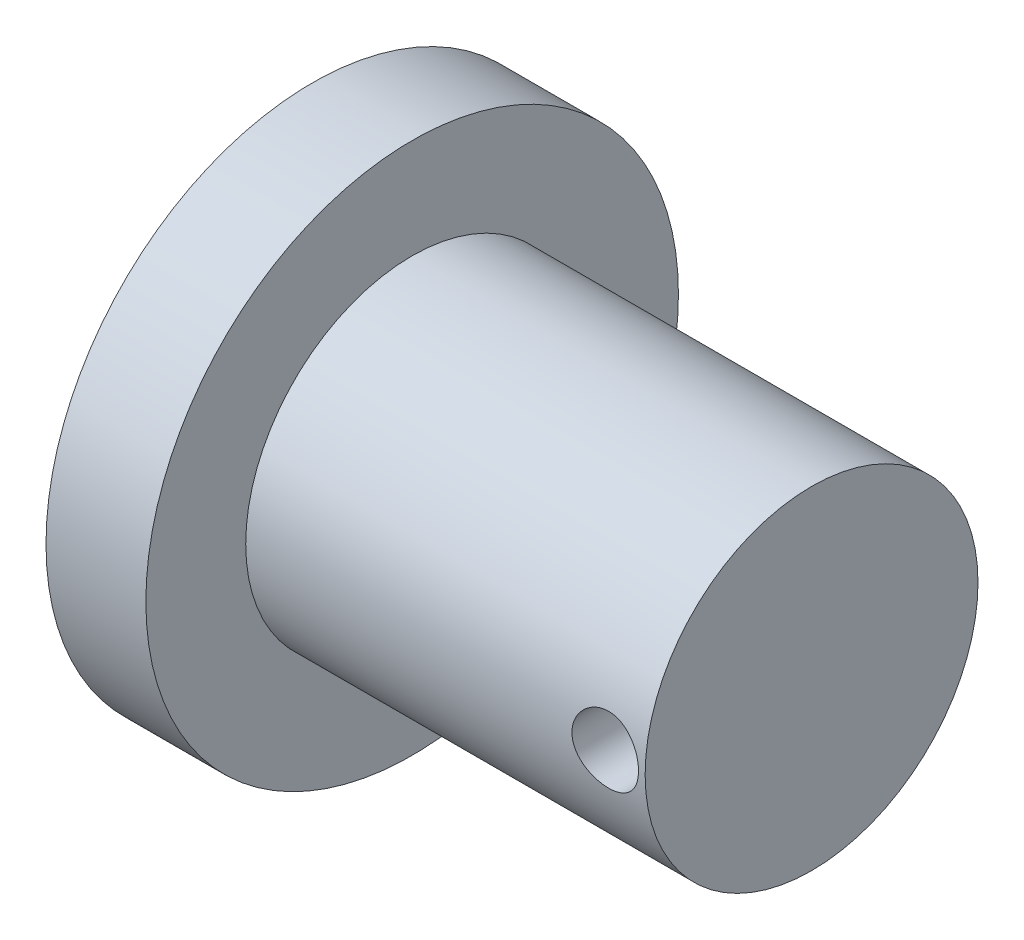
ISO-10303-21;
HEADER;
FILE_DESCRIPTION(('STEP AP214'),'2;1');
FILE_NAME('part.step','',(''),(''),'','','');
FILE_SCHEMA(('AUTOMOTIVE_DESIGN { 1 0 10303 214 1 1 1 1 }'));
ENDSEC;
DATA;
#1=APPLICATION_CONTEXT('core data for automotive mechanical design processes');
#2=APPLICATION_PROTOCOL_DEFINITION('international standard','automotive_design',2000,#1);
#3=PRODUCT_CONTEXT('',#1,'mechanical');
#4=PRODUCT('Part','Part','',(#3));
#5=PRODUCT_RELATED_PRODUCT_CATEGORY('part','',(#4));
#6=PRODUCT_DEFINITION_FORMATION('','',#4);
#7=PRODUCT_DEFINITION_CONTEXT('part definition',#1,'design');
#8=PRODUCT_DEFINITION('design','',#6,#7);
#9=PRODUCT_DEFINITION_SHAPE('','',#8);
#10=(LENGTH_UNIT() NAMED_UNIT(*) SI_UNIT(.MILLI.,.METRE.));
#11=(NAMED_UNIT(*) PLANE_ANGLE_UNIT() SI_UNIT($,.RADIAN.));
#12=(NAMED_UNIT(*) SI_UNIT($,.STERADIAN.) SOLID_ANGLE_UNIT());
#13=UNCERTAINTY_MEASURE_WITH_UNIT(LENGTH_MEASURE(1.E-05),#10,'distance_accuracy_value','');
#14=(GEOMETRIC_REPRESENTATION_CONTEXT(3) GLOBAL_UNCERTAINTY_ASSIGNED_CONTEXT((#13)) GLOBAL_UNIT_ASSIGNED_CONTEXT((#10,
#11,#12)) REPRESENTATION_CONTEXT('',''));
#15=CARTESIAN_POINT('',(0.,0.,0.));
#16=DIRECTION('',(0.,0.,1.));
#17=DIRECTION('',(1.,0.,0.));
#18=AXIS2_PLACEMENT_3D('',#15,#16,#17);
#19=CARTESIAN_POINT('',(-25.0884955752212,8.,0.));
#20=DIRECTION('',(1.,0.,0.));
#21=DIRECTION('',(0.,0.,-1.));
#22=AXIS2_PLACEMENT_3D('',#19,#20,#21);
#23=PLANE('',#22);
#24=CARTESIAN_POINT('',(-25.0884955752212,0.,0.));
#25=DIRECTION('',(-1.,0.,0.));
#26=DIRECTION('',(0.,0.,1.));
#27=AXIS2_PLACEMENT_3D('',#24,#25,#26);
#28=CIRCLE('',#27,8.);
#29=CARTESIAN_POINT('',(-25.0884955752212,0.,8.));
#30=VERTEX_POINT('',#29);
#31=EDGE_CURVE('E95',#30,#30,#28,.T.);
#32=ORIENTED_EDGE('',*,*,#31,.T.);
#33=EDGE_LOOP('',(#32));
#34=FACE_BOUND('',#33,.T.);
#35=ADVANCED_FACE('F37',(#34),#23,.F.);
#36=CARTESIAN_POINT('',(-10.0884955752212,0.,0.));
#37=DIRECTION('',(-1.,0.,0.));
#38=DIRECTION('',(0.,0.,1.));
#39=AXIS2_PLACEMENT_3D('',#36,#37,#38);
#40=PLANE('',#39);
#41=CARTESIAN_POINT('',(-10.0884955752212,0.,0.));
#42=DIRECTION('',(-1.,0.,0.));
#43=DIRECTION('',(0.,0.,1.));
#44=AXIS2_PLACEMENT_3D('',#41,#42,#43);
#45=CIRCLE('',#44,5.);
#46=CARTESIAN_POINT('',(-10.0884955752212,0.,5.));
#47=VERTEX_POINT('',#46);
#48=EDGE_CURVE('E10',#47,#47,#45,.T.);
#49=ORIENTED_EDGE('',*,*,#48,.F.);
#50=EDGE_LOOP('',(#49));
#51=FACE_BOUND('',#50,.T.);
#52=ADVANCED_FACE('F83',(#51),#40,.F.);
#53=CARTESIAN_POINT('',(-25.0884955752212,0.,0.));
#54=DIRECTION('',(-1.,0.,0.));
#55=DIRECTION('',(0.,0.,1.));
#56=AXIS2_PLACEMENT_3D('',#53,#54,#55);
#57=CYLINDRICAL_SURFACE('',#56,5.);
#58=CARTESIAN_POINT('',(-10.2884955752212,0.,5.));
#59=CARTESIAN_POINT('',(-10.2884976197196,-0.0555769067926333,4.99999897580871));
#60=CARTESIAN_POINT('',(-10.2931444181889,-0.111179660201523,4.99906385178231));
#61=CARTESIAN_POINT('',(-10.3115940753365,-0.22081350768902,4.99542365623231));
#62=CARTESIAN_POINT('',(-10.3254042080227,-0.274843317541356,4.99271717860186));
#63=CARTESIAN_POINT('',(-10.361736848842,-0.379730305263313,4.98583649278287));
#64=CARTESIAN_POINT('',(-10.3842510120659,-0.430590467933134,4.98166369076718));
#65=CARTESIAN_POINT('',(-10.4373278227325,-0.527807988864225,4.97230398035314));
#66=CARTESIAN_POINT('',(-10.4678899908284,-0.574165615075812,4.96711713235707));
#67=CARTESIAN_POINT('',(-10.5366340695127,-0.661693477314866,4.9562216532997));
#68=CARTESIAN_POINT('',(-10.5749039306124,-0.702793951158525,4.95050745504347));
#69=CARTESIAN_POINT('',(-10.6577879916129,-0.778036756608029,4.93924180452588));
#70=CARTESIAN_POINT('',(-10.7024026865563,-0.812178544770425,4.93369036500424));
#71=CARTESIAN_POINT('',(-10.7972117682331,-0.872831753347621,4.92332441812615));
#72=CARTESIAN_POINT('',(-10.8474532190176,-0.899270938865868,4.91851707364946));
#73=CARTESIAN_POINT('',(-10.9517773942253,-0.943305666580309,4.91026268058418));
#74=CARTESIAN_POINT('',(-11.0058597385676,-0.960902082437239,4.90681549761962));
#75=CARTESIAN_POINT('',(-11.1155799391291,-0.986525299884828,4.90172805252204));
#76=CARTESIAN_POINT('',(-11.1711881193634,-0.994674497958778,4.90006470107188));
#77=CARTESIAN_POINT('',(-11.2830053965856,-1.00155212772612,4.89866375060627));
#78=CARTESIAN_POINT('',(-11.3392144315414,-1.0002815227135,4.89892595467841));
#79=CARTESIAN_POINT('',(-11.4497423632422,-0.98845457310182,4.90132551148184));
#80=CARTESIAN_POINT('',(-11.5040769808485,-0.978038540243907,4.90343452858763));
#81=CARTESIAN_POINT('',(-11.6102116518842,-0.948437884623052,4.90924546160001));
#82=CARTESIAN_POINT('',(-11.6620115841402,-0.929252843100683,4.91294745357779));
#83=CARTESIAN_POINT('',(-11.7620108369248,-0.882524783674721,4.92155618500408));
#84=CARTESIAN_POINT('',(-11.8101834547904,-0.854926151232116,4.92647089813704));
#85=CARTESIAN_POINT('',(-11.901266425194,-0.79219357457268,4.93694618773062));
#86=CARTESIAN_POINT('',(-11.9441761720724,-0.75705876435683,4.94250683838366));
#87=CARTESIAN_POINT('',(-12.0243249776782,-0.679499934560585,4.95377021241462));
#88=CARTESIAN_POINT('',(-12.0614481430804,-0.636956161212446,4.95947369210905));
#89=CARTESIAN_POINT('',(-12.1280494215224,-0.54618502406201,4.97028848714408));
#90=CARTESIAN_POINT('',(-12.1575274365148,-0.49795758737939,4.97539979488974));
#91=CARTESIAN_POINT('',(-12.2080230844472,-0.397059386878922,4.98446690160887));
#92=CARTESIAN_POINT('',(-12.2290274688658,-0.344381819585301,4.98842088848272));
#93=CARTESIAN_POINT('',(-12.2618560492598,-0.236148976448666,4.99471408987858));
#94=CARTESIAN_POINT('',(-12.2736813572948,-0.180594050072451,4.99705350000531));
#95=CARTESIAN_POINT('',(-12.2876520290155,-0.0691794056271513,4.99982671866868));
#96=CARTESIAN_POINT('',(-12.2899559947615,-0.0133403283255771,5.0002917465247));
#97=CARTESIAN_POINT('',(-12.285245716279,0.0979249341927132,4.99935051930103));
#98=CARTESIAN_POINT('',(-12.2782319958686,0.153351142443792,4.99794436941446));
#99=CARTESIAN_POINT('',(-12.2552172016773,0.26170565994654,4.99343832008018));
#100=CARTESIAN_POINT('',(-12.2392975067233,0.314651948339903,4.99035376404206));
#101=CARTESIAN_POINT('',(-12.1990115925654,0.417123627499667,4.98283552061032));
#102=CARTESIAN_POINT('',(-12.1746447405444,0.466648761637539,4.97840173214227));
#103=CARTESIAN_POINT('',(-12.1178130845699,0.561541173686217,4.96859911533294));
#104=CARTESIAN_POINT('',(-12.0852527941823,0.606850126752188,4.96321950437052));
#105=CARTESIAN_POINT('',(-12.0130863840139,0.691418019119207,4.95214734829882));
#106=CARTESIAN_POINT('',(-11.9734795088214,0.730676308930763,4.94645476968388));
#107=CARTESIAN_POINT('',(-11.8876222233301,0.802640590774177,4.93529303556965));
#108=CARTESIAN_POINT('',(-11.8412798309999,0.835237702448656,4.92982860233304));
#109=CARTESIAN_POINT('',(-11.7436842138645,0.892185420051206,4.91984191796194));
#110=CARTESIAN_POINT('',(-11.6924311856477,0.916536355922903,4.91531962913342));
#111=CARTESIAN_POINT('',(-11.5867273290717,0.956151841581961,4.90776740584383));
#112=CARTESIAN_POINT('',(-11.5322947340109,0.971463499791052,4.90472974872186));
#113=CARTESIAN_POINT('',(-11.4215621217303,0.992708651627198,4.90047436792025));
#114=CARTESIAN_POINT('',(-11.3652623490119,0.998643368225114,4.89925640691111));
#115=CARTESIAN_POINT('',(-11.2534867106769,1.00092091086747,4.89879149631379));
#116=CARTESIAN_POINT('',(-11.1980144262942,0.997435788070897,4.89950919189301));
#117=CARTESIAN_POINT('',(-11.0884639253162,0.981352304100062,4.90275573484614));
#118=CARTESIAN_POINT('',(-11.0343856975264,0.9687540161293,4.90528456767169));
#119=CARTESIAN_POINT('',(-10.9292678639807,0.934878568498956,4.91185264219158));
#120=CARTESIAN_POINT('',(-10.8782212147188,0.913622506717347,4.9158882101883));
#121=CARTESIAN_POINT('',(-10.7803918544868,0.863054644601606,4.9250171497417));
#122=CARTESIAN_POINT('',(-10.7336095014961,0.833742168774884,4.93011060998894));
#123=CARTESIAN_POINT('',(-10.6447800030709,0.767305914786415,4.94088960523225));
#124=CARTESIAN_POINT('',(-10.6028268099536,0.730057887235181,4.94658372909699));
#125=CARTESIAN_POINT('',(-10.525709369692,0.649064369013141,4.95786081871955));
#126=CARTESIAN_POINT('',(-10.4905466849039,0.605317387153335,4.96344375863184));
#127=CARTESIAN_POINT('',(-10.4276609312748,0.512017629088247,4.97393832387971));
#128=CARTESIAN_POINT('',(-10.4000195719412,0.462408884429835,4.97884231219246));
#129=CARTESIAN_POINT('',(-10.3535094526246,0.359166360940733,4.98735125085));
#130=CARTESIAN_POINT('',(-10.3346327856887,0.305536260863127,4.99095737138616));
#131=CARTESIAN_POINT('',(-10.3098436271765,0.20982148892378,4.9957637259537));
#132=CARTESIAN_POINT('',(-10.3018523815135,0.168281664013785,4.99734303158452));
#133=CARTESIAN_POINT('',(-10.2911776628629,0.0844995252100672,4.99946154139893));
#134=CARTESIAN_POINT('',(-10.2884940207115,0.0422572337486192,5.00000077873155));
#135=CARTESIAN_POINT('',(-10.2884955752212,0.,5.));
#136=B_SPLINE_CURVE_WITH_KNOTS('',3,(#58,#59,#60,#61,#62,#63,#64,#65,#66,#67,#68,#69,#70,#71,
#72,#73,#74,#75,#76,#77,#78,#79,#80,#81,#82,#83,#84,#85,#86,#87,#88,#89,#90,#91,#92,#93,#94,#95,
#96,#97,#98,#99,#100,#101,#102,#103,#104,#105,#106,#107,#108,#109,#110,#111,#112,#113,#114,#115,
#116,#117,#118,#119,#120,#121,#122,#123,#124,#125,#126,#127,#128,#129,#130,#131,#132,#133,#134,
#135),.UNSPECIFIED.,.T.,.F.,(4,2,2,2,2,2,2,2,2,2,2,2,2,2,2,2,2,2,2,2,2,2,2,2,2,2,2,2,2,2,2,2,2,
2,2,2,2,2,4),(0.,0.166576130661259,0.333284650691323,0.499833735250342,0.666372902230863,
0.834932670112187,1.00350559674737,1.17361195005923,1.34370149365198,1.51156185103588,
1.67940504281225,1.84471727006278,2.0100373925373,2.17647490203593,2.34293154749671,
2.51238252491351,2.68183567539821,2.85155274854024,3.02124925698036,3.18810735676266,
3.35495607657868,3.52030453950724,3.68566539216023,3.85305066033359,4.02045388345931,
4.19040628579226,4.36035188723467,4.52940381032724,4.69843368330415,4.86439722567702,
5.03035943492609,5.19591961253111,5.36149367581867,5.52988076239144,5.69830654532931,
5.86849496675638,6.0385295551752,6.16518775289895,6.29184191370997),.UNSPECIFIED.);
#137=CARTESIAN_POINT('',(-10.2884955752212,0.,5.));
#138=VERTEX_POINT('',#137);
#139=EDGE_CURVE('E40',#138,#138,#136,.T.);
#140=ORIENTED_EDGE('',*,*,#139,.T.);
#141=EDGE_LOOP('',(#140));
#142=FACE_BOUND('',#141,.T.);
#143=CARTESIAN_POINT('',(-10.2884955752212,0.,-5.));
#144=CARTESIAN_POINT('',(-10.2884976197196,0.0555769067926333,-4.99999897580871));
#145=CARTESIAN_POINT('',(-10.2931444181889,0.111179660201523,-4.99906385178231));
#146=CARTESIAN_POINT('',(-10.3115940753365,0.22081350768902,-4.99542365623231));
#147=CARTESIAN_POINT('',(-10.3254042080227,0.274843317541356,-4.99271717860186));
#148=CARTESIAN_POINT('',(-10.361736848842,0.379730305263313,-4.98583649278287));
#149=CARTESIAN_POINT('',(-10.3842510120659,0.430590467933134,-4.98166369076718));
#150=CARTESIAN_POINT('',(-10.4373278227325,0.527807988864225,-4.97230398035314));
#151=CARTESIAN_POINT('',(-10.4678899908284,0.574165615075812,-4.96711713235707));
#152=CARTESIAN_POINT('',(-10.5366340695127,0.661693477314866,-4.9562216532997));
#153=CARTESIAN_POINT('',(-10.5749039306124,0.702793951158525,-4.95050745504347));
#154=CARTESIAN_POINT('',(-10.6577879916129,0.778036756608029,-4.93924180452588));
#155=CARTESIAN_POINT('',(-10.7024026865563,0.812178544770425,-4.93369036500424));
#156=CARTESIAN_POINT('',(-10.7972117682331,0.872831753347621,-4.92332441812615));
#157=CARTESIAN_POINT('',(-10.8474532190176,0.899270938865868,-4.91851707364946));
#158=CARTESIAN_POINT('',(-10.9517773942253,0.943305666580309,-4.91026268058418));
#159=CARTESIAN_POINT('',(-11.0058597385676,0.960902082437239,-4.90681549761962));
#160=CARTESIAN_POINT('',(-11.1155799391291,0.986525299884828,-4.90172805252204));
#161=CARTESIAN_POINT('',(-11.1711881193634,0.994674497958778,-4.90006470107188));
#162=CARTESIAN_POINT('',(-11.2830053965856,1.00155212772612,-4.89866375060627));
#163=CARTESIAN_POINT('',(-11.3392144315414,1.0002815227135,-4.89892595467841));
#164=CARTESIAN_POINT('',(-11.4497423632422,0.98845457310182,-4.90132551148184));
#165=CARTESIAN_POINT('',(-11.5040769808485,0.978038540243907,-4.90343452858763));
#166=CARTESIAN_POINT('',(-11.6102116518842,0.948437884623052,-4.90924546160001));
#167=CARTESIAN_POINT('',(-11.6620115841402,0.929252843100683,-4.91294745357779));
#168=CARTESIAN_POINT('',(-11.7620108369248,0.882524783674721,-4.92155618500408));
#169=CARTESIAN_POINT('',(-11.8101834547904,0.854926151232116,-4.92647089813704));
#170=CARTESIAN_POINT('',(-11.901266425194,0.79219357457268,-4.93694618773062));
#171=CARTESIAN_POINT('',(-11.9441761720724,0.75705876435683,-4.94250683838366));
#172=CARTESIAN_POINT('',(-12.0243249776782,0.679499934560585,-4.95377021241462));
#173=CARTESIAN_POINT('',(-12.0614481430804,0.636956161212446,-4.95947369210905));
#174=CARTESIAN_POINT('',(-12.1280494215224,0.54618502406201,-4.97028848714408));
#175=CARTESIAN_POINT('',(-12.1575274365148,0.49795758737939,-4.97539979488974));
#176=CARTESIAN_POINT('',(-12.2080230844472,0.397059386878922,-4.98446690160887));
#177=CARTESIAN_POINT('',(-12.2290274688658,0.344381819585301,-4.98842088848272));
#178=CARTESIAN_POINT('',(-12.2618560492598,0.236148976448666,-4.99471408987858));
#179=CARTESIAN_POINT('',(-12.2736813572948,0.180594050072451,-4.99705350000531));
#180=CARTESIAN_POINT('',(-12.2876520290155,0.0691794056271513,-4.99982671866868));
#181=CARTESIAN_POINT('',(-12.2899559947615,0.0133403283255771,-5.0002917465247));
#182=CARTESIAN_POINT('',(-12.285245716279,-0.0979249341927132,-4.99935051930103));
#183=CARTESIAN_POINT('',(-12.2782319958686,-0.153351142443792,-4.99794436941446));
#184=CARTESIAN_POINT('',(-12.2552172016773,-0.26170565994654,-4.99343832008018));
#185=CARTESIAN_POINT('',(-12.2392975067233,-0.314651948339903,-4.99035376404206));
#186=CARTESIAN_POINT('',(-12.1990115925654,-0.417123627499667,-4.98283552061032));
#187=CARTESIAN_POINT('',(-12.1746447405444,-0.466648761637539,-4.97840173214227));
#188=CARTESIAN_POINT('',(-12.1178130845699,-0.561541173686217,-4.96859911533294));
#189=CARTESIAN_POINT('',(-12.0852527941823,-0.606850126752188,-4.96321950437052));
#190=CARTESIAN_POINT('',(-12.0130863840139,-0.691418019119207,-4.95214734829882));
#191=CARTESIAN_POINT('',(-11.9734795088214,-0.730676308930763,-4.94645476968388));
#192=CARTESIAN_POINT('',(-11.8876222233301,-0.802640590774177,-4.93529303556965));
#193=CARTESIAN_POINT('',(-11.8412798309999,-0.835237702448656,-4.92982860233304));
#194=CARTESIAN_POINT('',(-11.7436842138645,-0.892185420051206,-4.91984191796194));
#195=CARTESIAN_POINT('',(-11.6924311856477,-0.916536355922903,-4.91531962913342));
#196=CARTESIAN_POINT('',(-11.5867273290717,-0.956151841581961,-4.90776740584383));
#197=CARTESIAN_POINT('',(-11.5322947340109,-0.971463499791052,-4.90472974872186));
#198=CARTESIAN_POINT('',(-11.4215621217303,-0.992708651627198,-4.90047436792025));
#199=CARTESIAN_POINT('',(-11.3652623490119,-0.998643368225114,-4.89925640691111));
#200=CARTESIAN_POINT('',(-11.2534867106769,-1.00092091086747,-4.89879149631379));
#201=CARTESIAN_POINT('',(-11.1980144262942,-0.997435788070897,-4.89950919189301));
#202=CARTESIAN_POINT('',(-11.0884639253162,-0.981352304100062,-4.90275573484614));
#203=CARTESIAN_POINT('',(-11.0343856975264,-0.9687540161293,-4.90528456767169));
#204=CARTESIAN_POINT('',(-10.9292678639807,-0.934878568498956,-4.91185264219158));
#205=CARTESIAN_POINT('',(-10.8782212147188,-0.913622506717347,-4.9158882101883));
#206=CARTESIAN_POINT('',(-10.7803918544868,-0.863054644601606,-4.9250171497417));
#207=CARTESIAN_POINT('',(-10.7336095014961,-0.833742168774884,-4.93011060998894));
#208=CARTESIAN_POINT('',(-10.6447800030709,-0.767305914786415,-4.94088960523225));
#209=CARTESIAN_POINT('',(-10.6028268099536,-0.730057887235181,-4.94658372909699));
#210=CARTESIAN_POINT('',(-10.525709369692,-0.649064369013141,-4.95786081871955));
#211=CARTESIAN_POINT('',(-10.4905466849039,-0.605317387153335,-4.96344375863184));
#212=CARTESIAN_POINT('',(-10.4276609312748,-0.512017629088247,-4.97393832387971));
#213=CARTESIAN_POINT('',(-10.4000195719412,-0.462408884429835,-4.97884231219246));
#214=CARTESIAN_POINT('',(-10.3535094526246,-0.359166360940733,-4.98735125085));
#215=CARTESIAN_POINT('',(-10.3346327856887,-0.305536260863127,-4.99095737138616));
#216=CARTESIAN_POINT('',(-10.3098436271765,-0.20982148892378,-4.9957637259537));
#217=CARTESIAN_POINT('',(-10.3018523815135,-0.168281664013785,-4.99734303158452));
#218=CARTESIAN_POINT('',(-10.2911776628629,-0.0844995252100672,-4.99946154139893));
#219=CARTESIAN_POINT('',(-10.2884940207115,-0.0422572337486192,-5.00000077873155));
#220=CARTESIAN_POINT('',(-10.2884955752212,0.,-5.));
#221=B_SPLINE_CURVE_WITH_KNOTS('',3,(#143,#144,#145,#146,#147,#148,#149,#150,#151,#152,#153,
#154,#155,#156,#157,#158,#159,#160,#161,#162,#163,#164,#165,#166,#167,#168,#169,#170,#171,#172,
#173,#174,#175,#176,#177,#178,#179,#180,#181,#182,#183,#184,#185,#186,#187,#188,#189,#190,#191,
#192,#193,#194,#195,#196,#197,#198,#199,#200,#201,#202,#203,#204,#205,#206,#207,#208,#209,#210,
#211,#212,#213,#214,#215,#216,#217,#218,#219,#220),.UNSPECIFIED.,.T.,.F.,(4,2,2,2,2,2,2,2,2,2,2,
2,2,2,2,2,2,2,2,2,2,2,2,2,2,2,2,2,2,2,2,2,2,2,2,2,2,2,4),(0.,0.166576130661259,
0.333284650691323,0.499833735250342,0.666372902230863,0.834932670112187,1.00350559674737,
1.17361195005923,1.34370149365198,1.51156185103588,1.67940504281225,1.84471727006278,
2.0100373925373,2.17647490203593,2.34293154749671,2.51238252491351,2.68183567539821,
2.85155274854024,3.02124925698036,3.18810735676266,3.35495607657868,3.52030453950724,
3.68566539216023,3.85305066033359,4.02045388345931,4.19040628579226,4.36035188723467,
4.52940381032724,4.69843368330415,4.86439722567702,5.03035943492609,5.19591961253111,
5.36149367581867,5.52988076239144,5.69830654532931,5.86849496675638,6.0385295551752,
6.16518775289895,6.29184191370997),.UNSPECIFIED.);
#222=CARTESIAN_POINT('',(-10.2884955752212,0.,-5.));
#223=VERTEX_POINT('',#222);
#224=EDGE_CURVE('E59',#223,#223,#221,.T.);
#225=ORIENTED_EDGE('',*,*,#224,.T.);
#226=EDGE_LOOP('',(#225));
#227=FACE_BOUND('',#226,.T.);
#228=CARTESIAN_POINT('',(-22.0884955752212,0.,0.));
#229=DIRECTION('',(-1.,0.,0.));
#230=DIRECTION('',(0.,0.,1.));
#231=AXIS2_PLACEMENT_3D('',#228,#229,#230);
#232=CIRCLE('',#231,5.);
#233=CARTESIAN_POINT('',(-22.0884955752212,0.,5.));
#234=VERTEX_POINT('',#233);
#235=EDGE_CURVE('E50',#234,#234,#232,.T.);
#236=ORIENTED_EDGE('',*,*,#235,.F.);
#237=EDGE_LOOP('',(#236));
#238=FACE_BOUND('',#237,.T.);
#239=ORIENTED_EDGE('',*,*,#48,.T.);
#240=EDGE_LOOP('',(#239));
#241=FACE_BOUND('',#240,.T.);
#242=ADVANCED_FACE('F65',(#142,#227,#238,#241),#57,.T.);
#243=CARTESIAN_POINT('',(-22.0884955752212,5.,0.));
#244=DIRECTION('',(-1.,0.,0.));
#245=DIRECTION('',(0.,0.,1.));
#246=AXIS2_PLACEMENT_3D('',#243,#244,#245);
#247=PLANE('',#246);
#248=CARTESIAN_POINT('',(-22.0884955752212,0.,0.));
#249=DIRECTION('',(-1.,0.,0.));
#250=DIRECTION('',(0.,0.,1.));
#251=AXIS2_PLACEMENT_3D('',#248,#249,#250);
#252=CIRCLE('',#251,8.);
#253=CARTESIAN_POINT('',(-22.0884955752212,0.,8.));
#254=VERTEX_POINT('',#253);
#255=EDGE_CURVE('E56',#254,#254,#252,.T.);
#256=ORIENTED_EDGE('',*,*,#255,.F.);
#257=EDGE_LOOP('',(#256));
#258=FACE_BOUND('',#257,.T.);
#259=ORIENTED_EDGE('',*,*,#235,.T.);
#260=EDGE_LOOP('',(#259));
#261=FACE_BOUND('',#260,.T.);
#262=ADVANCED_FACE('F76',(#258,#261),#247,.F.);
#263=CARTESIAN_POINT('',(-25.0884955752212,0.,0.));
#264=DIRECTION('',(-1.,0.,0.));
#265=DIRECTION('',(0.,0.,1.));
#266=AXIS2_PLACEMENT_3D('',#263,#264,#265);
#267=CYLINDRICAL_SURFACE('',#266,8.);
#268=ORIENTED_EDGE('',*,*,#31,.F.);
#269=EDGE_LOOP('',(#268));
#270=FACE_BOUND('',#269,.T.);
#271=ORIENTED_EDGE('',*,*,#255,.T.);
#272=EDGE_LOOP('',(#271));
#273=FACE_BOUND('',#272,.T.);
#274=ADVANCED_FACE('F72',(#270,#273),#267,.T.);
#275=CARTESIAN_POINT('',(-11.2884955752212,0.,-8.));
#276=DIRECTION('',(0.,0.,1.));
#277=DIRECTION('',(1.,0.,0.));
#278=AXIS2_PLACEMENT_3D('',#275,#276,#277);
#279=CYLINDRICAL_SURFACE('',#278,1.);
#280=ORIENTED_EDGE('',*,*,#224,.F.);
#281=EDGE_LOOP('',(#280));
#282=FACE_BOUND('',#281,.T.);
#283=ORIENTED_EDGE('',*,*,#139,.F.);
#284=EDGE_LOOP('',(#283));
#285=FACE_BOUND('',#284,.T.);
#286=ADVANCED_FACE('F68',(#282,#285),#279,.F.);
#287=CLOSED_SHELL('',(#35,#52,#242,#262,#274,#286));
#288=MANIFOLD_SOLID_BREP('B2',#287);
#289=ADVANCED_BREP_SHAPE_REPRESENTATION('',(#18,#288),#14);
#290=SHAPE_DEFINITION_REPRESENTATION(#9,#289);
ENDSEC;
END-ISO-10303-21;
